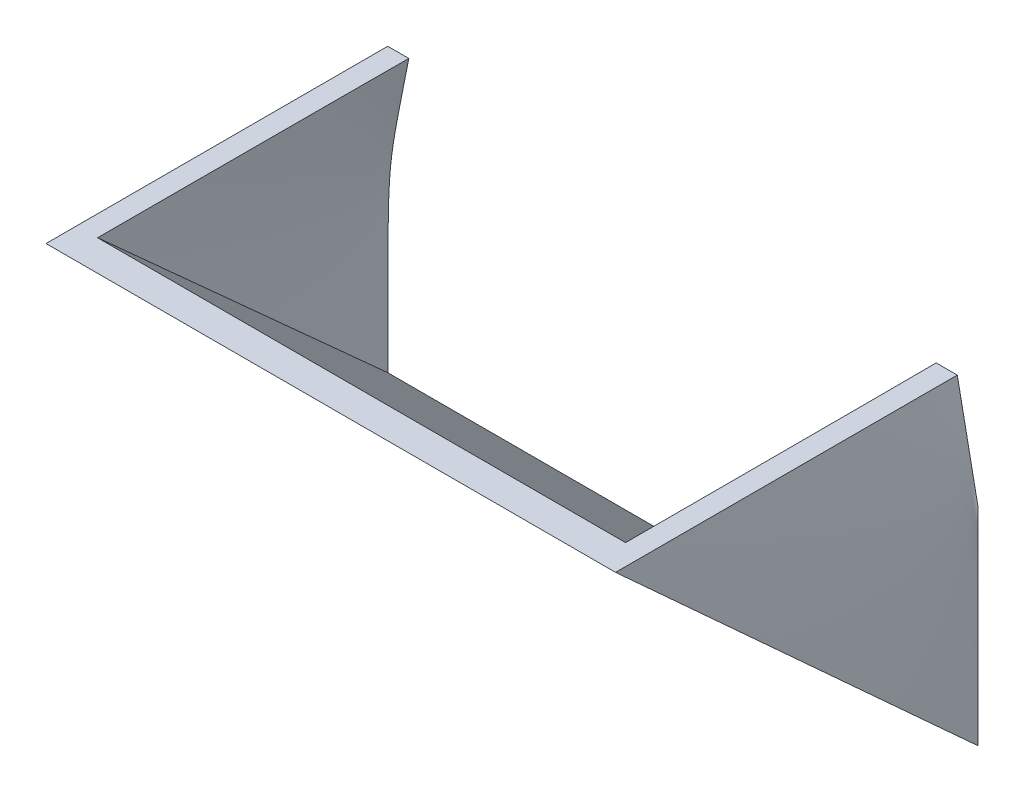
ISO-10303-21;
HEADER;
FILE_DESCRIPTION(('STEP AP214'),'2;1');
FILE_NAME('part.step','',(''),(''),'','','');
FILE_SCHEMA(('AUTOMOTIVE_DESIGN { 1 0 10303 214 1 1 1 1 }'));
ENDSEC;
DATA;
#1=APPLICATION_CONTEXT('core data for automotive mechanical design processes');
#2=APPLICATION_PROTOCOL_DEFINITION('international standard','automotive_design',2000,#1);
#3=PRODUCT_CONTEXT('',#1,'mechanical');
#4=PRODUCT('Part','Part','',(#3));
#5=PRODUCT_RELATED_PRODUCT_CATEGORY('part','',(#4));
#6=PRODUCT_DEFINITION_FORMATION('','',#4);
#7=PRODUCT_DEFINITION_CONTEXT('part definition',#1,'design');
#8=PRODUCT_DEFINITION('design','',#6,#7);
#9=PRODUCT_DEFINITION_SHAPE('','',#8);
#10=(LENGTH_UNIT() NAMED_UNIT(*) SI_UNIT(.MILLI.,.METRE.));
#11=(NAMED_UNIT(*) PLANE_ANGLE_UNIT() SI_UNIT($,.RADIAN.));
#12=(NAMED_UNIT(*) SI_UNIT($,.STERADIAN.) SOLID_ANGLE_UNIT());
#13=UNCERTAINTY_MEASURE_WITH_UNIT(LENGTH_MEASURE(1.E-05),#10,'distance_accuracy_value','');
#14=(GEOMETRIC_REPRESENTATION_CONTEXT(3) GLOBAL_UNCERTAINTY_ASSIGNED_CONTEXT((#13)) GLOBAL_UNIT_ASSIGNED_CONTEXT((#10,
#11,#12)) REPRESENTATION_CONTEXT('',''));
#15=CARTESIAN_POINT('',(0.,0.,0.));
#16=DIRECTION('',(0.,0.,1.));
#17=DIRECTION('',(1.,0.,0.));
#18=AXIS2_PLACEMENT_3D('',#15,#16,#17);
#19=CARTESIAN_POINT('',(0.,0.,0.));
#20=DIRECTION('',(0.,0.,1.));
#21=DIRECTION('',(1.,0.,0.));
#22=AXIS2_PLACEMENT_3D('',#19,#20,#21);
#23=PLANE('',#22);
#24=CARTESIAN_POINT('',(-13.7478827857078,-4.24859095987477,0.));
#25=CARTESIAN_POINT('',(-13.7477757846932,-4.01270696408464,0.));
#26=CARTESIAN_POINT('',(-13.7476582462511,-3.77682297141519,0.));
#27=CARTESIAN_POINT('',(-13.7473904297984,-3.30506203831825,0.));
#28=CARTESIAN_POINT('',(-13.747240152764,-3.06918509789021,0.));
#29=CARTESIAN_POINT('',(-13.7468951920049,-2.597434777658,0.));
#30=CARTESIAN_POINT('',(-13.7467005089444,-2.36156139785337,0.));
#31=CARTESIAN_POINT('',(-13.7462474097695,-1.8897945617377,0.));
#32=CARTESIAN_POINT('',(-13.7459889882159,-1.65390110543167,0.));
#33=CARTESIAN_POINT('',(-13.7453781181529,-1.18211076827975,0.));
#34=CARTESIAN_POINT('',(-13.7450256682313,-0.946213887435635,0.));
#35=CARTESIAN_POINT('',(-13.7441776318025,-0.474413222131551,0.));
#36=CARTESIAN_POINT('',(-13.7436820409619,-0.238509437678811,0.));
#37=CARTESIAN_POINT('',(-13.7426661982534,0.153859652641056,0.));
#38=CARTESIAN_POINT('',(-13.7422104473086,0.310325121522398,0.));
#39=CARTESIAN_POINT('',(-13.7411561092042,0.623250851983049,0.));
#40=CARTESIAN_POINT('',(-13.7405575263725,0.779711113576502,0.));
#41=CARTESIAN_POINT('',(-13.7391564930514,1.09261667906372,0.));
#42=CARTESIAN_POINT('',(-13.7383540609125,1.24906198303652,0.));
#43=CARTESIAN_POINT('',(-13.7364510279551,1.56194493603612,0.));
#44=CARTESIAN_POINT('',(-13.7353504383895,1.71838258512901,0.));
#45=CARTESIAN_POINT('',(-13.7327047381712,2.03126845461214,0.));
#46=CARTESIAN_POINT('',(-13.7311595873996,2.18771667468186,0.));
#47=CARTESIAN_POINT('',(-13.7273931947187,2.50065834751747,0.));
#48=CARTESIAN_POINT('',(-13.7251717235242,2.65715179761389,0.));
#49=CARTESIAN_POINT('',(-13.7191378576892,3.00243692118407,0.));
#50=CARTESIAN_POINT('',(-13.7150916635792,3.19122483414973,0.));
#51=CARTESIAN_POINT('',(-13.70454510581,3.56873039041685,0.));
#52=CARTESIAN_POINT('',(-13.6980448296752,3.75744803598414,0.));
#53=CARTESIAN_POINT('',(-13.6812108533297,4.13462238032964,0.));
#54=CARTESIAN_POINT('',(-13.6708791911169,4.3230791644693,0.));
#55=CARTESIAN_POINT('',(-13.6448424576443,4.6995263114031,0.));
#56=CARTESIAN_POINT('',(-13.6291404739225,4.88751687982168,0.));
#57=CARTESIAN_POINT('',(-13.5913769566505,5.26281905855958,0.));
#58=CARTESIAN_POINT('',(-13.5693168864865,5.45013081508146,0.));
#59=CARTESIAN_POINT('',(-13.5192213986393,5.82403502994578,0.));
#60=CARTESIAN_POINT('',(-13.4911830435127,6.01062708861001,0.));
#61=CARTESIAN_POINT('',(-13.4308257108127,6.3832007977511,0.));
#62=CARTESIAN_POINT('',(-13.3985045321596,6.56918208362443,0.));
#63=CARTESIAN_POINT('',(-13.3314560250139,6.94069543612902,0.));
#64=CARTESIAN_POINT('',(-13.2967287970056,7.12622752118584,0.));
#65=CARTESIAN_POINT('',(-13.2355154261145,7.44747560298055,0.));
#66=CARTESIAN_POINT('',(-13.209308925071,7.58324533569042,0.));
#67=CARTESIAN_POINT('',(-13.1565105147607,7.85467714899229,0.));
#68=CARTESIAN_POINT('',(-13.1299186961557,7.99033924723353,0.));
#69=CARTESIAN_POINT('',(-13.0498006951322,8.39730877579616,0.));
#70=CARTESIAN_POINT('',(-12.9959414404052,8.66855047607766,0.));
#71=CARTESIAN_POINT('',(-12.8879213743052,9.21097556290724,0.));
#72=CARTESIAN_POINT('',(-12.8337605608183,9.48215894903268,0.));
#73=CARTESIAN_POINT('',(-12.7253049152653,10.0244671239295,0.));
#74=CARTESIAN_POINT('',(-12.6710100990047,10.2955919158601,0.));
#75=CARTESIAN_POINT('',(-12.6167257267201,10.5667188034188,0.));
#76=B_SPLINE_CURVE_WITH_KNOTS('',3,(#24,#25,#26,#27,#28,#29,#30,#31,#32,#33,#34,#35,#36,#37,#38,
#39,#40,#41,#42,#43,#44,#45,#46,#47,#48,#49,#50,#51,#52,#53,#54,#55,#56,#57,#58,#59,#60,#61,#62,
#63,#64,#65,#66,#67,#68,#69,#70,#71,#72,#73,#74,#75),.UNSPECIFIED.,.F.,.F.,(4,2,2,2,2,2,2,2,2,2,
2,2,2,2,2,2,2,2,2,2,2,2,2,2,2,4),(0.,0.707652062483311,1.41528302481236,2.1229033996862,
2.8305841801336,3.53827558954622,4.24598842584111,4.71538677930668,5.18477091126861,
5.654112804456,6.12343698650933,6.59280353544508,7.06232938590081,7.62881393360103,
8.19527827965511,8.76144174215238,9.32728024815038,9.89298862381918,10.4589756047446,
11.0252546008704,11.5915099616095,12.0063368360287,12.4210676411794,13.2506788658427,
14.0802959131437,14.9098193847671),.UNSPECIFIED.);
#77=CARTESIAN_POINT('',(-13.7475844088689,-3.64853920478922,0.));
#78=VERTEX_POINT('',#77);
#79=CARTESIAN_POINT('',(-12.7301858208042,10.,0.));
#80=VERTEX_POINT('',#79);
#81=EDGE_CURVE('E134',#78,#80,#76,.T.);
#82=ORIENTED_EDGE('',*,*,#81,.F.);
#83=DIRECTION('',(1.,0.,0.));
#84=VECTOR('',#83,1.);
#85=CARTESIAN_POINT('',(0.,-3.64853920478922,0.));
#86=LINE('',#85,#84);
#87=CARTESIAN_POINT('',(13.7475844088689,-3.64853920478922,0.));
#88=VERTEX_POINT('',#87);
#89=EDGE_CURVE('E124',#78,#88,#86,.T.);
#90=ORIENTED_EDGE('',*,*,#89,.T.);
#91=CARTESIAN_POINT('',(13.7478827857078,-4.24859095987442,0.));
#92=CARTESIAN_POINT('',(13.747802917206,-4.07176878742669,0.));
#93=CARTESIAN_POINT('',(13.7477167437973,-3.89494661740605,0.));
#94=CARTESIAN_POINT('',(13.7475274769216,-3.54129950975968,0.));
#95=CARTESIAN_POINT('',(13.7474243831889,-3.36447457213409,0.));
#96=CARTESIAN_POINT('',(13.7471969664718,-3.010822864122,0.));
#97=CARTESIAN_POINT('',(13.7470726432656,-2.83399609373563,0.));
#98=CARTESIAN_POINT('',(13.7467965218388,-2.48034165645731,0.));
#99=CARTESIAN_POINT('',(13.7466447234756,-2.30351398956547,0.));
#100=CARTESIAN_POINT('',(13.7463049579747,-1.94967721273486,0.));
#101=CARTESIAN_POINT('',(13.7461169538772,-1.77266810283085,0.));
#102=CARTESIAN_POINT('',(13.7456927744709,-1.41865085298661,0.));
#103=CARTESIAN_POINT('',(13.7454565994107,-1.24164271304607,0.));
#104=CARTESIAN_POINT('',(13.7449187360439,-0.887628343396339,0.));
#105=CARTESIAN_POINT('',(13.7446170484086,-0.710622113686154,0.));
#106=CARTESIAN_POINT('',(13.7439222342747,-0.356612517482937,0.));
#107=CARTESIAN_POINT('',(13.7435291091647,-0.179609150987243,0.));
#108=CARTESIAN_POINT('',(13.7424928247956,0.221039411019479,0.));
#109=CARTESIAN_POINT('',(13.7418110766623,0.444684511224115,0.));
#110=CARTESIAN_POINT('',(13.7401130988722,0.891977541679219,0.));
#111=CARTESIAN_POINT('',(13.7390968632419,1.1156254719089,0.));
#112=CARTESIAN_POINT('',(13.7364961684131,1.5629326878592,0.));
#113=CARTESIAN_POINT('',(13.7349116723967,1.78659197337652,0.));
#114=CARTESIAN_POINT('',(13.7307365333054,2.23378010323749,0.));
#115=CARTESIAN_POINT('',(13.7281464405932,2.45730895206525,0.));
#116=CARTESIAN_POINT('',(13.7211310403669,2.9043280092142,0.));
#117=CARTESIAN_POINT('',(13.7167058274162,3.12781821893289,0.));
#118=CARTESIAN_POINT('',(13.7045161556882,3.5747084551756,0.));
#119=CARTESIAN_POINT('',(13.6967518955069,3.79810848627231,0.));
#120=CARTESIAN_POINT('',(13.6808552528455,4.13325700310293,0.));
#121=CARTESIAN_POINT('',(13.6748390395892,4.24510419116714,0.));
#122=CARTESIAN_POINT('',(13.6610588217719,4.46868898240683,0.));
#123=CARTESIAN_POINT('',(13.6532948731638,4.58042658897551,0.));
#124=CARTESIAN_POINT('',(13.635740187583,4.80373702988446,0.));
#125=CARTESIAN_POINT('',(13.6259495750994,4.91530987392162,0.));
#126=CARTESIAN_POINT('',(13.6041680704679,5.13820649926779,0.));
#127=CARTESIAN_POINT('',(13.592177858917,5.24953034686579,0.));
#128=CARTESIAN_POINT('',(13.5659844026194,5.47192387931155,0.));
#129=CARTESIAN_POINT('',(13.5517810200395,5.58299354789197,0.));
#130=CARTESIAN_POINT('',(13.521340514352,5.80485310156811,0.));
#131=CARTESIAN_POINT('',(13.5051033746863,5.91564298437844,0.));
#132=CARTESIAN_POINT('',(13.4697803856512,6.14438149743847,0.));
#133=CARTESIAN_POINT('',(13.450576503905,6.26231177073529,0.));
#134=CARTESIAN_POINT('',(13.4107151819265,6.49792398814949,0.));
#135=CARTESIAN_POINT('',(13.3900577447994,6.61560593279681,0.));
#136=CARTESIAN_POINT('',(13.3477387375192,6.85079011090436,0.));
#137=CARTESIAN_POINT('',(13.3260771498824,6.96829234119867,0.));
#138=CARTESIAN_POINT('',(13.2820818880654,7.20325248559525,0.));
#139=CARTESIAN_POINT('',(13.2597477699033,7.32071031618626,0.));
#140=CARTESIAN_POINT('',(13.2146605605566,7.55554247609609,0.));
#141=CARTESIAN_POINT('',(13.1919074791219,7.67291680729225,0.));
#142=CARTESIAN_POINT('',(13.1461357118336,7.90761297733709,0.));
#143=CARTESIAN_POINT('',(13.1231170272862,8.02493481644099,0.));
#144=CARTESIAN_POINT('',(13.0742839763444,8.27288370567406,0.));
#145=CARTESIAN_POINT('',(13.0484493374073,8.40350675886438,0.));
#146=CARTESIAN_POINT('',(12.9966524578093,8.66472816856101,0.));
#147=CARTESIAN_POINT('',(12.9706902165576,8.79532652495009,0.));
#148=CARTESIAN_POINT('',(12.9186865757623,9.05650782717158,0.));
#149=CARTESIAN_POINT('',(12.8926451760103,9.18709077296252,0.));
#150=CARTESIAN_POINT('',(12.840542742905,9.44809694834633,0.));
#151=CARTESIAN_POINT('',(12.8144817663624,9.57852018928347,0.));
#152=CARTESIAN_POINT('',(12.7623289671692,9.83936012623143,0.));
#153=CARTESIAN_POINT('',(12.7362371446044,9.9697768222594,0.));
#154=CARTESIAN_POINT('',(12.6840334270547,10.2306054113337,0.));
#155=CARTESIAN_POINT('',(12.6579215321869,10.3610173044035,0.));
#156=CARTESIAN_POINT('',(12.6318048728294,10.4914282416502,1.8985057666579E-13));
#157=B_SPLINE_CURVE_WITH_KNOTS('',3,(#91,#92,#93,#94,#95,#96,#97,#98,#99,#100,#101,#102,#103,
#104,#105,#106,#107,#108,#109,#110,#111,#112,#113,#114,#115,#116,#117,#118,#119,#120,#121,#122,
#123,#124,#125,#126,#127,#128,#129,#130,#131,#132,#133,#134,#135,#136,#137,#138,#139,#140,#141,
#142,#143,#144,#145,#146,#147,#148,#149,#150,#151,#152,#153,#154,#155,#156),.UNSPECIFIED.,.F.,
.F.,(4,2,2,2,2,2,2,2,2,2,2,2,2,2,2,2,2,2,2,2,2,2,2,2,2,2,2,2,2,2,2,2,4),(0.,0.530466571975941,
1.0609414741382,1.59142191476299,2.12190510820105,2.65293273260205,3.18395761666861,
3.71497706004352,4.24598843955663,4.91692672845598,5.58787700013022,6.25887075094935,
6.92949778366702,7.60009026340229,8.27064286393435,8.60665848618244,8.94266335258898,
9.27864758580042,9.61452803403815,9.95042940878078,10.2863335184678,10.6447718880288,
11.003209491899,11.3616533390246,11.7203392432621,12.0790168106843,12.4376926148779,
12.8371525147275,13.2366142652918,13.6360770672248,14.035081530868,14.4340848877176,
14.8330859328326),.UNSPECIFIED.);
#158=CARTESIAN_POINT('',(12.7301858208043,10.,0.));
#159=VERTEX_POINT('',#158);
#160=EDGE_CURVE('E73',#88,#159,#157,.T.);
#161=ORIENTED_EDGE('',*,*,#160,.T.);
#162=DIRECTION('',(1.,0.,0.));
#163=VECTOR('',#162,1.);
#164=CARTESIAN_POINT('',(13.75,10.,0.));
#165=LINE('',#164,#163);
#166=CARTESIAN_POINT('',(13.75,10.,0.));
#167=VERTEX_POINT('',#166);
#168=EDGE_CURVE('E137',#159,#167,#165,.T.);
#169=ORIENTED_EDGE('',*,*,#168,.T.);
#170=DIRECTION('',(-0.196116135138182,0.98058067569092,0.));
#171=VECTOR('',#170,1.);
#172=CARTESIAN_POINT('',(14.25,7.5,0.));
#173=LINE('',#172,#171);
#174=CARTESIAN_POINT('',(14.75,5.,0.));
#175=VERTEX_POINT('',#174);
#176=EDGE_CURVE('E240',#175,#167,#173,.T.);
#177=ORIENTED_EDGE('',*,*,#176,.F.);
#178=DIRECTION('',(0.,1.,0.));
#179=VECTOR('',#178,1.);
#180=CARTESIAN_POINT('',(14.75,-5.,0.));
#181=LINE('',#180,#179);
#182=CARTESIAN_POINT('',(14.75,-5.,0.));
#183=VERTEX_POINT('',#182);
#184=EDGE_CURVE('E142',#183,#175,#181,.T.);
#185=ORIENTED_EDGE('',*,*,#184,.F.);
#186=DIRECTION('',(1.,0.,0.));
#187=VECTOR('',#186,1.);
#188=CARTESIAN_POINT('',(14.75,-5.,0.));
#189=LINE('',#188,#187);
#190=CARTESIAN_POINT('',(-14.75,-5.,0.));
#191=VERTEX_POINT('',#190);
#192=EDGE_CURVE('E244',#191,#183,#189,.T.);
#193=ORIENTED_EDGE('',*,*,#192,.F.);
#194=DIRECTION('',(0.,-1.,0.));
#195=VECTOR('',#194,1.);
#196=CARTESIAN_POINT('',(-14.75,-5.,0.));
#197=LINE('',#196,#195);
#198=CARTESIAN_POINT('',(-14.75,5.,0.));
#199=VERTEX_POINT('',#198);
#200=EDGE_CURVE('E139',#199,#191,#197,.T.);
#201=ORIENTED_EDGE('',*,*,#200,.F.);
#202=DIRECTION('',(0.196116135138186,0.98058067569092,0.));
#203=VECTOR('',#202,1.);
#204=CARTESIAN_POINT('',(-14.75,5.,0.));
#205=LINE('',#204,#203);
#206=CARTESIAN_POINT('',(-13.75,10.,0.));
#207=VERTEX_POINT('',#206);
#208=EDGE_CURVE('E261',#199,#207,#205,.T.);
#209=ORIENTED_EDGE('',*,*,#208,.T.);
#210=EDGE_CURVE('E65',#207,#80,#165,.T.);
#211=ORIENTED_EDGE('',*,*,#210,.T.);
#212=EDGE_LOOP('',(#82,#90,#161,#169,#177,#185,#193,#201,#209,#211));
#213=FACE_BOUND('',#212,.T.);
#214=ADVANCED_FACE('F49',(#213),#23,.F.);
#215=CARTESIAN_POINT('',(0.,10.,0.));
#216=DIRECTION('',(0.,-1.,0.));
#217=DIRECTION('',(0.,0.,-1.));
#218=AXIS2_PLACEMENT_3D('',#215,#216,#217);
#219=PLANE('',#218);
#220=ORIENTED_EDGE('',*,*,#168,.F.);
#221=CARTESIAN_POINT('',(12.7479432699102,10.,17.535198194233));
#222=CARTESIAN_POINT('',(12.7478177155566,10.,16.7614828249936));
#223=CARTESIAN_POINT('',(12.7476786227224,10.,15.9877674563037));
#224=CARTESIAN_POINT('',(12.7473506777839,10.,14.4403369221766));
#225=CARTESIAN_POINT('',(12.7471618256919,10.,13.6666217567394));
#226=CARTESIAN_POINT('',(12.7467116798808,10.,12.1191914182515));
#227=CARTESIAN_POINT('',(12.746450386159,10.,11.3454762452009));
#228=CARTESIAN_POINT('',(12.7458126217599,9.99999999999999,9.79804574972432));
#229=CARTESIAN_POINT('',(12.745436151054,10.,9.02433042729844));
#230=CARTESIAN_POINT('',(12.7444732045287,10.,7.45090654305757));
#231=CARTESIAN_POINT('',(12.7438800983878,10.,6.65119798526239));
#232=CARTESIAN_POINT('',(12.7423195921696,10.,5.05178163856745));
#233=CARTESIAN_POINT('',(12.7413521923122,9.99999999999999,4.25207384966752));
#234=CARTESIAN_POINT('',(12.7393129731571,9.99999999999999,3.05251224404471));
#235=CARTESIAN_POINT('',(12.7385352123857,10.,2.65265795639589));
#236=CARTESIAN_POINT('',(12.7366751759456,10.,1.85295026346173));
#237=CARTESIAN_POINT('',(12.7355929004107,10.,1.45309685817608));
#238=CARTESIAN_POINT('',(12.7329708599782,10.,0.653390548015866));
#239=CARTESIAN_POINT('',(12.7314310941491,10.,0.253537643143972));
#240=CARTESIAN_POINT('',(12.7275669368275,10.,-0.546164892194431));
#241=CARTESIAN_POINT('',(12.7252425441106,10.,-0.946014522654857));
#242=CARTESIAN_POINT('',(12.7223622710331,10.,-1.34586091208567));
#243=B_SPLINE_CURVE_WITH_KNOTS('',3,(#221,#222,#223,#224,#225,#226,#227,#228,#229,#230,#231,
#232,#233,#234,#235,#236,#237,#238,#239,#240,#241,#242),.UNSPECIFIED.,.F.,.F.,(4,2,2,2,2,2,2,2,
2,2,4),(0.,2.32114614079909,4.64229170420587,6.96343735188666,9.28458357602159,11.6837098859138,
14.0828347862771,15.2823998288409,16.4819643442755,17.6815313020752,18.8811001315339),.UNSPECIFIED.);
#244=CARTESIAN_POINT('',(12.7474714401134,10.,15.0133931252682));
#245=VERTEX_POINT('',#244);
#246=EDGE_CURVE('E118',#159,#245,#243,.F.);
#247=ORIENTED_EDGE('',*,*,#246,.T.);
#248=DIRECTION('',(-1.,0.,0.));
#249=VECTOR('',#248,1.);
#250=CARTESIAN_POINT('',(0.,10.,15.0133931252681));
#251=LINE('',#250,#249);
#252=CARTESIAN_POINT('',(-12.7474714401134,10.,15.0133931252682));
#253=VERTEX_POINT('',#252);
#254=EDGE_CURVE('E128',#245,#253,#251,.T.);
#255=ORIENTED_EDGE('',*,*,#254,.T.);
#256=CARTESIAN_POINT('',(-12.7474714401134,10.,15.0133931252682));
#257=CARTESIAN_POINT('',(-12.7472929608708,10.,14.2136848752942));
#258=CARTESIAN_POINT('',(-12.7470949116701,10.,13.413976623794));
#259=CARTESIAN_POINT('',(-12.7466132738416,10.,11.8145598115597));
#260=CARTESIAN_POINT('',(-12.7463296851778,10.,11.0148512508256));
#261=CARTESIAN_POINT('',(-12.7456080343967,10.,9.36388023276291));
#262=CARTESIAN_POINT('',(-12.7451611925585,9.99999999999999,8.51261777917567));
#263=CARTESIAN_POINT('',(-12.744002245639,10.,6.81009329042058));
#264=CARTESIAN_POINT('',(-12.7432901406408,10.,5.95883125525269));
#265=CARTESIAN_POINT('',(-12.7418208069606,10.,4.68193779503981));
#266=CARTESIAN_POINT('',(-12.7412641656175,10.,4.25630615077881));
#267=CARTESIAN_POINT('',(-12.7399474323476,9.99999999999999,3.40504324475932));
#268=CARTESIAN_POINT('',(-12.7391873404536,10.,2.97941198300076));
#269=CARTESIAN_POINT('',(-12.7373669526861,10.,2.12814969856991));
#270=CARTESIAN_POINT('',(-12.7363066565791,10.,1.70251867589806));
#271=CARTESIAN_POINT('',(-12.7336786261354,10.,0.851257994588232));
#272=CARTESIAN_POINT('',(-12.7321108915082,10.,0.425628335951178));
#273=CARTESIAN_POINT('',(-12.7301858208042,10.,0.));
#274=B_SPLINE_CURVE_WITH_KNOTS('',3,(#256,#257,#258,#259,#260,#261,#262,#263,#264,#265,#266,
#267,#268,#269,#270,#271,#272,#273),.UNSPECIFIED.,.F.,.F.,(4,2,2,2,2,2,2,2,4),(0.,
2.39912481910984,4.79825064567929,7.35203834544881,9.90582524426364,11.1827212313536,
12.4596170117239,13.7365137852313,15.0134112898909),.UNSPECIFIED.);
#275=EDGE_CURVE('E133',#253,#80,#274,.T.);
#276=ORIENTED_EDGE('',*,*,#275,.T.);
#277=ORIENTED_EDGE('',*,*,#210,.F.);
#278=DIRECTION('',(0.,0.,-1.));
#279=VECTOR('',#278,1.);
#280=CARTESIAN_POINT('',(-13.75,10.,0.));
#281=LINE('',#280,#279);
#282=CARTESIAN_POINT('',(-13.75,10.,16.5));
#283=VERTEX_POINT('',#282);
#284=EDGE_CURVE('E286',#283,#207,#281,.T.);
#285=ORIENTED_EDGE('',*,*,#284,.F.);
#286=DIRECTION('',(-1.,0.,0.));
#287=VECTOR('',#286,1.);
#288=CARTESIAN_POINT('',(13.75,10.,16.5));
#289=LINE('',#288,#287);
#290=CARTESIAN_POINT('',(13.75,10.,16.5));
#291=VERTEX_POINT('',#290);
#292=EDGE_CURVE('E215',#291,#283,#289,.T.);
#293=ORIENTED_EDGE('',*,*,#292,.F.);
#294=DIRECTION('',(0.,0.,1.));
#295=VECTOR('',#294,1.);
#296=CARTESIAN_POINT('',(13.75,10.,0.));
#297=LINE('',#296,#295);
#298=EDGE_CURVE('E12',#167,#291,#297,.T.);
#299=ORIENTED_EDGE('',*,*,#298,.F.);
#300=EDGE_LOOP('',(#220,#247,#255,#276,#277,#285,#293,#299));
#301=FACE_BOUND('',#300,.T.);
#302=ADVANCED_FACE('F51',(#301),#219,.F.);
#303=CARTESIAN_POINT('',(0.,-2.73755656108597,2.48868778280543));
#304=DIRECTION('',(0.,-0.739940073395944,0.672672793996312));
#305=DIRECTION('',(0.,-0.672672793996312,-0.739940073395944));
#306=AXIS2_PLACEMENT_3D('',#303,#304,#305);
#307=PLANE('',#306);
#308=DIRECTION('',(-0.0447998279689905,0.671997419534863,0.73919716148835));
#309=VECTOR('',#308,1.);
#310=CARTESIAN_POINT('',(14.75,-5.,0.));
#311=LINE('',#310,#309);
#312=EDGE_CURVE('E81',#183,#291,#311,.T.);
#313=ORIENTED_EDGE('',*,*,#312,.T.);
#314=ORIENTED_EDGE('',*,*,#292,.T.);
#315=DIRECTION('',(0.0447998279689913,0.671997419534863,0.73919716148835));
#316=VECTOR('',#315,1.);
#317=CARTESIAN_POINT('',(-14.75,-5.,0.));
#318=LINE('',#317,#316);
#319=EDGE_CURVE('E233',#191,#283,#318,.T.);
#320=ORIENTED_EDGE('',*,*,#319,.F.);
#321=ORIENTED_EDGE('',*,*,#192,.T.);
#322=EDGE_LOOP('',(#313,#314,#320,#321));
#323=FACE_BOUND('',#322,.T.);
#324=ADVANCED_FACE('F189',(#323),#307,.T.);
#325=CARTESIAN_POINT('',(-14.75,5.1,0.));
#326=CARTESIAN_POINT('',(-13.75,10.,-0.165000000000004));
#327=CARTESIAN_POINT('',(-13.7045307370348,10.2227993885292,-0.172502428389253));
#328=CARTESIAN_POINT('',(-14.75,5.06666666666667,0.));
#329=CARTESIAN_POINT('',(-13.75,10.,-0.110000000000004));
#330=CARTESIAN_POINT('',(-13.7045307370348,10.2243150306281,-0.11500161892617));
#331=CARTESIAN_POINT('',(-14.75,5.03333333333333,0.));
#332=CARTESIAN_POINT('',(-13.75,10.,-0.0550000000000035));
#333=CARTESIAN_POINT('',(-13.7045307370348,10.2258306727269,-0.0575008094630868));
#334=CARTESIAN_POINT('',(-14.75,5.,0.));
#335=CARTESIAN_POINT('',(-13.75,10.,0.));
#336=CARTESIAN_POINT('',(-13.7045307370348,10.2273463148257,0.));
#337=CARTESIAN_POINT('',(-14.75,3.33333333333334,0.));
#338=CARTESIAN_POINT('',(-13.75,10.,2.75));
#339=CARTESIAN_POINT('',(-13.7045307370348,10.3031284197676,2.87504047315415));
#340=CARTESIAN_POINT('',(-14.75,1.66666666666667,0.));
#341=CARTESIAN_POINT('',(-13.75,10.,5.5));
#342=CARTESIAN_POINT('',(-13.7045307370348,10.3789105247096,5.75008094630831));
#343=CARTESIAN_POINT('',(-14.75,-1.66666666666666,0.));
#344=CARTESIAN_POINT('',(-13.75,10.,11.));
#345=CARTESIAN_POINT('',(-13.7045307370348,10.5304747345934,11.5001618926166));
#346=CARTESIAN_POINT('',(-14.75,-3.33333333333333,0.));
#347=CARTESIAN_POINT('',(-13.75,10.,13.75));
#348=CARTESIAN_POINT('',(-13.7045307370348,10.6062568395353,14.3752023657708));
#349=CARTESIAN_POINT('',(-14.75,-5.,0.));
#350=CARTESIAN_POINT('',(-13.75,10.,16.5));
#351=CARTESIAN_POINT('',(-13.7045307370348,10.6820389444772,17.2502428389249));
#352=B_SPLINE_SURFACE_WITH_KNOTS('',3,1,((#325,#326,#327),(#328,#329,#330),(#331,#332,#333),
(#334,#335,#336),(#337,#338,#339),(#340,#341,#342),(#343,#344,#345),(#346,#347,#348),(#349,#350,
#351)),.UNSPECIFIED.,.F.,.F.,.F.,(4,3,2,4),(2,1,2),(-0.01,0.,0.5,1.),(0.,1.,1.04546926296515),.UNSPECIFIED.);
#353=ORIENTED_EDGE('',*,*,#200,.T.);
#354=ORIENTED_EDGE('',*,*,#319,.T.);
#355=ORIENTED_EDGE('',*,*,#284,.T.);
#356=ORIENTED_EDGE('',*,*,#208,.F.);
#357=EDGE_LOOP('',(#353,#354,#355,#356));
#358=FACE_BOUND('',#357,.T.);
#359=ADVANCED_FACE('F184',(#358),#352,.T.);
#360=CARTESIAN_POINT('',(14.75,-5.,0.));
#361=CARTESIAN_POINT('',(13.75,10.,16.5));
#362=CARTESIAN_POINT('',(13.7045307370349,10.6820389444772,17.2502428389249));
#363=CARTESIAN_POINT('',(14.75,-3.33333333333333,0.));
#364=CARTESIAN_POINT('',(13.75,10.,13.75));
#365=CARTESIAN_POINT('',(13.7045307370349,10.6062568395353,14.3752023657708));
#366=CARTESIAN_POINT('',(14.75,-1.66666666666666,0.));
#367=CARTESIAN_POINT('',(13.75,10.,11.));
#368=CARTESIAN_POINT('',(13.7045307370349,10.5304747345934,11.5001618926166));
#369=CARTESIAN_POINT('',(14.75,1.66666666666667,0.));
#370=CARTESIAN_POINT('',(13.75,10.,5.5));
#371=CARTESIAN_POINT('',(13.7045307370349,10.3789105247096,5.75008094630831));
#372=CARTESIAN_POINT('',(14.75,3.33333333333334,0.));
#373=CARTESIAN_POINT('',(13.75,10.,2.75));
#374=CARTESIAN_POINT('',(13.7045307370349,10.3031284197676,2.87504047315415));
#375=CARTESIAN_POINT('',(14.75,5.,0.));
#376=CARTESIAN_POINT('',(13.75,10.,0.));
#377=CARTESIAN_POINT('',(13.7045307370349,10.2273463148257,0.));
#378=CARTESIAN_POINT('',(14.75,5.03333333333334,0.));
#379=CARTESIAN_POINT('',(13.75,10.,-0.0550000000000035));
#380=CARTESIAN_POINT('',(13.7045307370349,10.2258306727269,-0.0575008094630868));
#381=CARTESIAN_POINT('',(14.75,5.06666666666667,0.));
#382=CARTESIAN_POINT('',(13.75,10.,-0.110000000000004));
#383=CARTESIAN_POINT('',(13.7045307370349,10.2243150306281,-0.11500161892617));
#384=CARTESIAN_POINT('',(14.75,5.1,0.));
#385=CARTESIAN_POINT('',(13.75,10.,-0.165000000000004));
#386=CARTESIAN_POINT('',(13.7045307370349,10.2227993885292,-0.172502428389253));
#387=B_SPLINE_SURFACE_WITH_KNOTS('',3,1,((#360,#361,#362),(#363,#364,#365),(#366,#367,#368),
(#369,#370,#371),(#372,#373,#374),(#375,#376,#377),(#378,#379,#380),(#381,#382,#383),(#384,#385,
#386)),.UNSPECIFIED.,.F.,.F.,.F.,(4,2,3,4),(2,1,2),(0.,0.5,1.,1.01),(0.,1.,1.04546926296515),.UNSPECIFIED.);
#388=ORIENTED_EDGE('',*,*,#184,.T.);
#389=ORIENTED_EDGE('',*,*,#176,.T.);
#390=ORIENTED_EDGE('',*,*,#298,.T.);
#391=ORIENTED_EDGE('',*,*,#312,.F.);
#392=EDGE_LOOP('',(#388,#389,#390,#391));
#393=FACE_BOUND('',#392,.T.);
#394=ADVANCED_FACE('F160',(#393),#387,.T.);
#395=CARTESIAN_POINT('',(0.,-1.99761648769003,1.81601498880912));
#396=DIRECTION('',(0.,-0.739940073395944,0.672672793996312));
#397=DIRECTION('',(0.,-0.672672793996312,-0.739940073395944));
#398=AXIS2_PLACEMENT_3D('',#395,#396,#397);
#399=PLANE('',#398);
#400=CARTESIAN_POINT('',(13.7475844088689,-3.64853920478922,0.));
#401=CARTESIAN_POINT('',(13.7040994820568,-3.07991254934988,0.625489320983276));
#402=CARTESIAN_POINT('',(13.6609492830771,-2.51127436570539,1.25099132299222));
#403=CARTESIAN_POINT('',(13.5752211113531,-1.37397859506231,2.5020166706996));
#404=CARTESIAN_POINT('',(13.5326431384867,-0.805321008067885,3.12754001639347));
#405=CARTESIAN_POINT('',(13.4267917601083,0.616345222135977,4.69137286961772));
#406=CARTESIAN_POINT('',(13.3638152189033,1.46936386099649,5.62969337236429));
#407=CARTESIAN_POINT('',(13.2387003059022,3.17542907443086,7.50636510714209));
#408=CARTESIAN_POINT('',(13.1765619342613,4.02847564900986,8.44471633917899));
#409=CARTESIAN_POINT('',(13.0529538551138,5.73459192142548,10.3214442388362));
#410=CARTESIAN_POINT('',(12.9914841485624,6.58766161929339,11.2598209064909));
#411=CARTESIAN_POINT('',(12.8690948647288,8.29381857503759,13.1365935578095));
#412=CARTESIAN_POINT('',(12.8081752872521,9.14690583290756,14.0749895414665));
#413=CARTESIAN_POINT('',(12.7474714401134,10.,15.0133931252682));
#414=B_SPLINE_CURVE_WITH_KNOTS('',3,(#400,#401,#402,#403,#404,#405,#406,#407,#408,#409,#410,
#411,#412,#413),.UNSPECIFIED.,.F.,.F.,(4,2,2,2,2,2,4),(0.,2.53932589042299,5.07865123918243,
8.88764940598102,12.6966482780739,16.5056525911956,20.3146555576877),.UNSPECIFIED.);
#415=EDGE_CURVE('E114',#88,#245,#414,.T.);
#416=ORIENTED_EDGE('',*,*,#415,.F.);
#417=ORIENTED_EDGE('',*,*,#89,.F.);
#418=CARTESIAN_POINT('',(-13.7475844088689,-3.64853920478922,0.));
#419=CARTESIAN_POINT('',(-13.7040994820568,-3.07991254934988,0.625489320983277));
#420=CARTESIAN_POINT('',(-13.6609492830771,-2.51127436570539,1.25099132299222));
#421=CARTESIAN_POINT('',(-13.5752211113531,-1.37397859506231,2.5020166706996));
#422=CARTESIAN_POINT('',(-13.5326431384867,-0.805321008067886,3.12754001639347));
#423=CARTESIAN_POINT('',(-13.4267917601083,0.616345222135976,4.69137286961772));
#424=CARTESIAN_POINT('',(-13.3638152189033,1.46936386099649,5.62969337236428));
#425=CARTESIAN_POINT('',(-13.2387003059022,3.17542907443086,7.50636510714209));
#426=CARTESIAN_POINT('',(-13.1765619342613,4.02847564900986,8.44471633917899));
#427=CARTESIAN_POINT('',(-13.0529538551138,5.73459192142548,10.3214442388362));
#428=CARTESIAN_POINT('',(-12.9914841485624,6.58766161929339,11.2598209064909));
#429=CARTESIAN_POINT('',(-12.8690948647288,8.29381857503759,13.1365935578095));
#430=CARTESIAN_POINT('',(-12.8081752872521,9.14690583290756,14.0749895414665));
#431=CARTESIAN_POINT('',(-12.7474714401134,10.,15.0133931252682));
#432=B_SPLINE_CURVE_WITH_KNOTS('',3,(#418,#419,#420,#421,#422,#423,#424,#425,#426,#427,#428,
#429,#430,#431),.UNSPECIFIED.,.F.,.F.,(4,2,2,2,2,2,4),(0.,2.53932589042299,5.07865123918243,
8.88764940598101,12.6966482780739,16.5056525911956,20.3146555576876),.UNSPECIFIED.);
#433=EDGE_CURVE('E123',#78,#253,#432,.T.);
#434=ORIENTED_EDGE('',*,*,#433,.T.);
#435=ORIENTED_EDGE('',*,*,#254,.F.);
#436=EDGE_LOOP('',(#416,#417,#434,#435));
#437=FACE_BOUND('',#436,.T.);
#438=ADVANCED_FACE('F129',(#437),#399,.F.);
#439=CARTESIAN_POINT('',(-14.75,5.1,0.));
#440=CARTESIAN_POINT('',(-13.7045307370348,10.2227993885292,-0.172502428389253));
#441=CARTESIAN_POINT('',(-14.75,5.06666666666667,0.));
#442=CARTESIAN_POINT('',(-13.7045307370348,10.2243150306281,-0.11500161892617));
#443=CARTESIAN_POINT('',(-14.75,5.03333333333333,0.));
#444=CARTESIAN_POINT('',(-13.7045307370348,10.2258306727269,-0.0575008094630868));
#445=CARTESIAN_POINT('',(-14.75,3.33333333333334,0.));
#446=CARTESIAN_POINT('',(-13.7045307370348,10.3031284197676,2.87504047315415));
#447=CARTESIAN_POINT('',(-14.75,1.66666666666667,0.));
#448=CARTESIAN_POINT('',(-13.7045307370348,10.3789105247096,5.75008094630831));
#449=CARTESIAN_POINT('',(-14.75,-1.66666666666666,0.));
#450=CARTESIAN_POINT('',(-13.7045307370348,10.5304747345934,11.5001618926166));
#451=CARTESIAN_POINT('',(-14.75,-3.33333333333333,0.));
#452=CARTESIAN_POINT('',(-13.7045307370348,10.6062568395353,14.3752023657708));
#453=CARTESIAN_POINT('',(-14.75,-5.,0.));
#454=CARTESIAN_POINT('',(-13.7045307370348,10.6820389444772,17.2502428389249));
#455=B_SPLINE_SURFACE_WITH_KNOTS('',3,1,((#439,#440),(#441,#442),(#443,#444),(#445,#446),(#447,
#448),(#449,#450),(#451,#452),(#453,#454)),.UNSPECIFIED.,.F.,.F.,.F.,(4,2,2,4),(2,2),(-0.01,0.,
0.5,1.),(0.,1.04546926296515),.UNSPECIFIED.);
#456=OFFSET_SURFACE('',#455,-1.,.F.);
#457=ORIENTED_EDGE('',*,*,#433,.F.);
#458=ORIENTED_EDGE('',*,*,#81,.T.);
#459=ORIENTED_EDGE('',*,*,#275,.F.);
#460=EDGE_LOOP('',(#457,#458,#459));
#461=FACE_BOUND('',#460,.T.);
#462=ADVANCED_FACE('F175',(#461),#456,.F.);
#463=CARTESIAN_POINT('',(14.75,-5.,0.));
#464=CARTESIAN_POINT('',(13.7045307370349,10.6820389444772,17.2502428389249));
#465=CARTESIAN_POINT('',(14.75,-3.33333333333333,0.));
#466=CARTESIAN_POINT('',(13.7045307370349,10.6062568395353,14.3752023657708));
#467=CARTESIAN_POINT('',(14.75,-1.66666666666666,0.));
#468=CARTESIAN_POINT('',(13.7045307370349,10.5304747345934,11.5001618926166));
#469=CARTESIAN_POINT('',(14.75,1.66666666666667,0.));
#470=CARTESIAN_POINT('',(13.7045307370349,10.3789105247096,5.75008094630831));
#471=CARTESIAN_POINT('',(14.75,3.33333333333334,0.));
#472=CARTESIAN_POINT('',(13.7045307370349,10.3031284197676,2.87504047315415));
#473=CARTESIAN_POINT('',(14.75,5.03333333333334,0.));
#474=CARTESIAN_POINT('',(13.7045307370349,10.2258306727269,-0.0575008094630868));
#475=CARTESIAN_POINT('',(14.75,5.06666666666667,0.));
#476=CARTESIAN_POINT('',(13.7045307370349,10.2243150306281,-0.11500161892617));
#477=CARTESIAN_POINT('',(14.75,5.1,0.));
#478=CARTESIAN_POINT('',(13.7045307370349,10.2227993885292,-0.172502428389253));
#479=B_SPLINE_SURFACE_WITH_KNOTS('',3,1,((#463,#464),(#465,#466),(#467,#468),(#469,#470),(#471,
#472),(#473,#474),(#475,#476),(#477,#478)),.UNSPECIFIED.,.F.,.F.,.F.,(4,2,2,4),(2,2),(0.,0.5,1.,
1.01),(0.,1.04546926296515),.UNSPECIFIED.);
#480=OFFSET_SURFACE('',#479,-1.,.F.);
#481=ORIENTED_EDGE('',*,*,#160,.F.);
#482=ORIENTED_EDGE('',*,*,#415,.T.);
#483=ORIENTED_EDGE('',*,*,#246,.F.);
#484=EDGE_LOOP('',(#481,#482,#483));
#485=FACE_BOUND('',#484,.T.);
#486=ADVANCED_FACE('F116',(#485),#480,.F.);
#487=CLOSED_SHELL('',(#214,#302,#324,#359,#394,#438,#462,#486));
#488=MANIFOLD_SOLID_BREP('B2',#487);
#489=ADVANCED_BREP_SHAPE_REPRESENTATION('',(#18,#488),#14);
#490=SHAPE_DEFINITION_REPRESENTATION(#9,#489);
ENDSEC;
END-ISO-10303-21;
